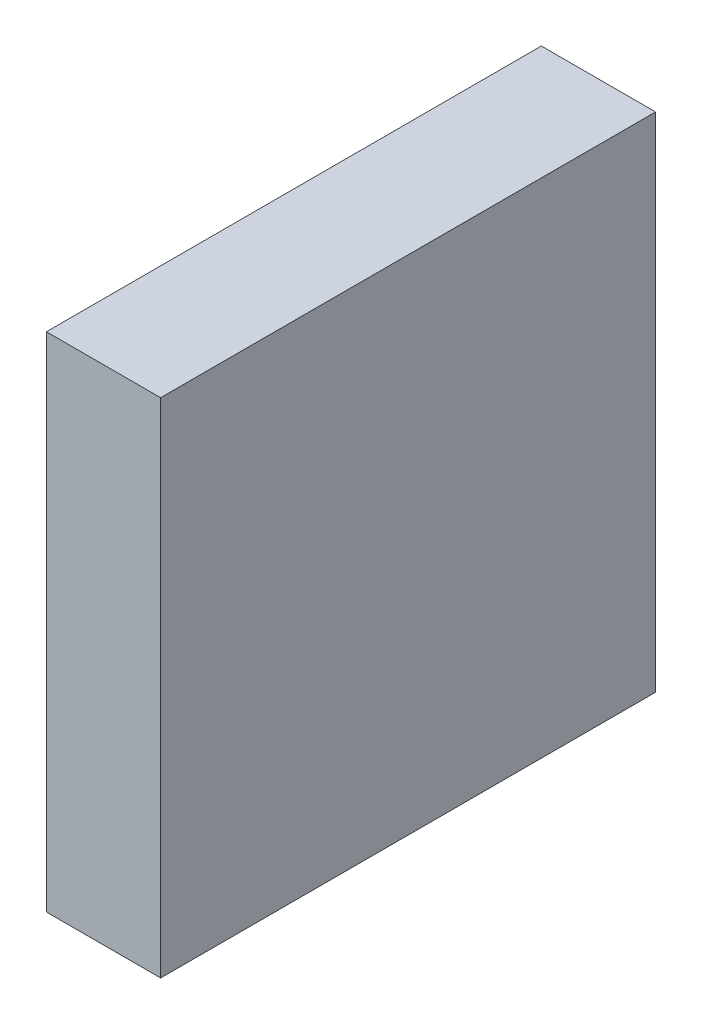
ISO-10303-21;
HEADER;
FILE_DESCRIPTION(('STEP AP214'),'2;1');
FILE_NAME('part.step','',(''),(''),'','','');
FILE_SCHEMA(('AUTOMOTIVE_DESIGN { 1 0 10303 214 1 1 1 1 }'));
ENDSEC;
DATA;
#1=APPLICATION_CONTEXT('core data for automotive mechanical design processes');
#2=APPLICATION_PROTOCOL_DEFINITION('international standard','automotive_design',2000,#1);
#3=PRODUCT_CONTEXT('',#1,'mechanical');
#4=PRODUCT('Part','Part','',(#3));
#5=PRODUCT_RELATED_PRODUCT_CATEGORY('part','',(#4));
#6=PRODUCT_DEFINITION_FORMATION('','',#4);
#7=PRODUCT_DEFINITION_CONTEXT('part definition',#1,'design');
#8=PRODUCT_DEFINITION('design','',#6,#7);
#9=PRODUCT_DEFINITION_SHAPE('','',#8);
#10=(LENGTH_UNIT() NAMED_UNIT(*) SI_UNIT(.MILLI.,.METRE.));
#11=(NAMED_UNIT(*) PLANE_ANGLE_UNIT() SI_UNIT($,.RADIAN.));
#12=(NAMED_UNIT(*) SI_UNIT($,.STERADIAN.) SOLID_ANGLE_UNIT());
#13=UNCERTAINTY_MEASURE_WITH_UNIT(LENGTH_MEASURE(1.E-05),#10,'distance_accuracy_value','');
#14=(GEOMETRIC_REPRESENTATION_CONTEXT(3) GLOBAL_UNCERTAINTY_ASSIGNED_CONTEXT((#13)) GLOBAL_UNIT_ASSIGNED_CONTEXT((#10,
#11,#12)) REPRESENTATION_CONTEXT('',''));
#15=CARTESIAN_POINT('',(0.,0.,0.));
#16=DIRECTION('',(0.,0.,1.));
#17=DIRECTION('',(1.,0.,0.));
#18=AXIS2_PLACEMENT_3D('',#15,#16,#17);
#19=CARTESIAN_POINT('',(0.,0.,0.));
#20=DIRECTION('',(1.,0.,0.));
#21=DIRECTION('',(0.,0.,1.));
#22=AXIS2_PLACEMENT_3D('',#19,#20,#21);
#23=PLANE('',#22);
#24=DIRECTION('',(0.,1.,0.));
#25=VECTOR('',#24,1.);
#26=CARTESIAN_POINT('',(0.,0.,0.65));
#27=LINE('',#26,#25);
#28=CARTESIAN_POINT('',(0.,0.,0.65));
#29=VERTEX_POINT('',#28);
#30=CARTESIAN_POINT('',(0.,0.66,0.65));
#31=VERTEX_POINT('',#30);
#32=EDGE_CURVE('E11',#29,#31,#27,.T.);
#33=ORIENTED_EDGE('',*,*,#32,.T.);
#34=DIRECTION('',(0.,0.,1.));
#35=VECTOR('',#34,1.);
#36=CARTESIAN_POINT('',(0.,0.66,0.));
#37=LINE('',#36,#35);
#38=CARTESIAN_POINT('',(0.,0.66,0.));
#39=VERTEX_POINT('',#38);
#40=EDGE_CURVE('E24',#39,#31,#37,.T.);
#41=ORIENTED_EDGE('',*,*,#40,.F.);
#42=DIRECTION('',(0.,1.,0.));
#43=VECTOR('',#42,1.);
#44=CARTESIAN_POINT('',(0.,0.,0.));
#45=LINE('',#44,#43);
#46=CARTESIAN_POINT('',(0.,0.,0.));
#47=VERTEX_POINT('',#46);
#48=EDGE_CURVE('E86',#47,#39,#45,.T.);
#49=ORIENTED_EDGE('',*,*,#48,.F.);
#50=DIRECTION('',(0.,0.,1.));
#51=VECTOR('',#50,1.);
#52=CARTESIAN_POINT('',(0.,0.,0.));
#53=LINE('',#52,#51);
#54=EDGE_CURVE('E36',#47,#29,#53,.T.);
#55=ORIENTED_EDGE('',*,*,#54,.T.);
#56=EDGE_LOOP('',(#33,#41,#49,#55));
#57=FACE_BOUND('',#56,.T.);
#58=ADVANCED_FACE('F17',(#57),#23,.F.);
#59=CARTESIAN_POINT('',(0.15,0.,0.));
#60=DIRECTION('',(1.,0.,0.));
#61=DIRECTION('',(0.,0.,1.));
#62=AXIS2_PLACEMENT_3D('',#59,#60,#61);
#63=PLANE('',#62);
#64=DIRECTION('',(0.,0.,1.));
#65=VECTOR('',#64,1.);
#66=CARTESIAN_POINT('',(0.15,0.,0.));
#67=LINE('',#66,#65);
#68=CARTESIAN_POINT('',(0.15,0.,0.));
#69=VERTEX_POINT('',#68);
#70=CARTESIAN_POINT('',(0.15,0.,0.65));
#71=VERTEX_POINT('',#70);
#72=EDGE_CURVE('E83',#69,#71,#67,.T.);
#73=ORIENTED_EDGE('',*,*,#72,.F.);
#74=DIRECTION('',(0.,1.,0.));
#75=VECTOR('',#74,1.);
#76=CARTESIAN_POINT('',(0.15,0.,0.));
#77=LINE('',#76,#75);
#78=CARTESIAN_POINT('',(0.15,0.66,0.));
#79=VERTEX_POINT('',#78);
#80=EDGE_CURVE('E63',#69,#79,#77,.T.);
#81=ORIENTED_EDGE('',*,*,#80,.T.);
#82=DIRECTION('',(0.,0.,1.));
#83=VECTOR('',#82,1.);
#84=CARTESIAN_POINT('',(0.15,0.66,0.));
#85=LINE('',#84,#83);
#86=CARTESIAN_POINT('',(0.15,0.66,0.65));
#87=VERTEX_POINT('',#86);
#88=EDGE_CURVE('E57',#79,#87,#85,.T.);
#89=ORIENTED_EDGE('',*,*,#88,.T.);
#90=DIRECTION('',(0.,1.,0.));
#91=VECTOR('',#90,1.);
#92=CARTESIAN_POINT('',(0.15,0.,0.65));
#93=LINE('',#92,#91);
#94=EDGE_CURVE('E60',#71,#87,#93,.T.);
#95=ORIENTED_EDGE('',*,*,#94,.F.);
#96=EDGE_LOOP('',(#73,#81,#89,#95));
#97=FACE_BOUND('',#96,.T.);
#98=ADVANCED_FACE('F59',(#97),#63,.T.);
#99=CARTESIAN_POINT('',(0.,0.,0.));
#100=DIRECTION('',(0.,1.,0.));
#101=DIRECTION('',(0.,0.,1.));
#102=AXIS2_PLACEMENT_3D('',#99,#100,#101);
#103=PLANE('',#102);
#104=ORIENTED_EDGE('',*,*,#72,.T.);
#105=DIRECTION('',(1.,0.,0.));
#106=VECTOR('',#105,1.);
#107=CARTESIAN_POINT('',(0.,0.,0.65));
#108=LINE('',#107,#106);
#109=EDGE_CURVE('E71',#29,#71,#108,.T.);
#110=ORIENTED_EDGE('',*,*,#109,.F.);
#111=ORIENTED_EDGE('',*,*,#54,.F.);
#112=DIRECTION('',(1.,0.,0.));
#113=VECTOR('',#112,1.);
#114=CARTESIAN_POINT('',(0.,0.,0.));
#115=LINE('',#114,#113);
#116=EDGE_CURVE('E76',#47,#69,#115,.T.);
#117=ORIENTED_EDGE('',*,*,#116,.T.);
#118=EDGE_LOOP('',(#104,#110,#111,#117));
#119=FACE_BOUND('',#118,.T.);
#120=ADVANCED_FACE('F91',(#119),#103,.F.);
#121=CARTESIAN_POINT('',(0.,0.66,0.));
#122=DIRECTION('',(0.,1.,0.));
#123=DIRECTION('',(0.,0.,1.));
#124=AXIS2_PLACEMENT_3D('',#121,#122,#123);
#125=PLANE('',#124);
#126=DIRECTION('',(1.,0.,0.));
#127=VECTOR('',#126,1.);
#128=CARTESIAN_POINT('',(0.,0.66,0.));
#129=LINE('',#128,#127);
#130=EDGE_CURVE('E74',#39,#79,#129,.T.);
#131=ORIENTED_EDGE('',*,*,#130,.F.);
#132=ORIENTED_EDGE('',*,*,#40,.T.);
#133=DIRECTION('',(1.,0.,0.));
#134=VECTOR('',#133,1.);
#135=CARTESIAN_POINT('',(0.,0.66,0.65));
#136=LINE('',#135,#134);
#137=EDGE_CURVE('E69',#31,#87,#136,.T.);
#138=ORIENTED_EDGE('',*,*,#137,.T.);
#139=ORIENTED_EDGE('',*,*,#88,.F.);
#140=EDGE_LOOP('',(#131,#132,#138,#139));
#141=FACE_BOUND('',#140,.T.);
#142=ADVANCED_FACE('F73',(#141),#125,.T.);
#143=CARTESIAN_POINT('',(0.,0.,0.));
#144=DIRECTION('',(0.,0.,1.));
#145=DIRECTION('',(1.,0.,0.));
#146=AXIS2_PLACEMENT_3D('',#143,#144,#145);
#147=PLANE('',#146);
#148=ORIENTED_EDGE('',*,*,#130,.T.);
#149=ORIENTED_EDGE('',*,*,#80,.F.);
#150=ORIENTED_EDGE('',*,*,#116,.F.);
#151=ORIENTED_EDGE('',*,*,#48,.T.);
#152=EDGE_LOOP('',(#148,#149,#150,#151));
#153=FACE_BOUND('',#152,.T.);
#154=ADVANCED_FACE('F89',(#153),#147,.F.);
#155=CARTESIAN_POINT('',(0.,0.,0.65));
#156=DIRECTION('',(0.,0.,1.));
#157=DIRECTION('',(1.,0.,0.));
#158=AXIS2_PLACEMENT_3D('',#155,#156,#157);
#159=PLANE('',#158);
#160=ORIENTED_EDGE('',*,*,#32,.F.);
#161=ORIENTED_EDGE('',*,*,#109,.T.);
#162=ORIENTED_EDGE('',*,*,#94,.T.);
#163=ORIENTED_EDGE('',*,*,#137,.F.);
#164=EDGE_LOOP('',(#160,#161,#162,#163));
#165=FACE_BOUND('',#164,.T.);
#166=ADVANCED_FACE('F68',(#165),#159,.T.);
#167=CLOSED_SHELL('',(#58,#98,#120,#142,#154,#166));
#168=MANIFOLD_SOLID_BREP('B1',#167);
#169=ADVANCED_BREP_SHAPE_REPRESENTATION('',(#18,#168),#14);
#170=SHAPE_DEFINITION_REPRESENTATION(#9,#169);
ENDSEC;
END-ISO-10303-21;
